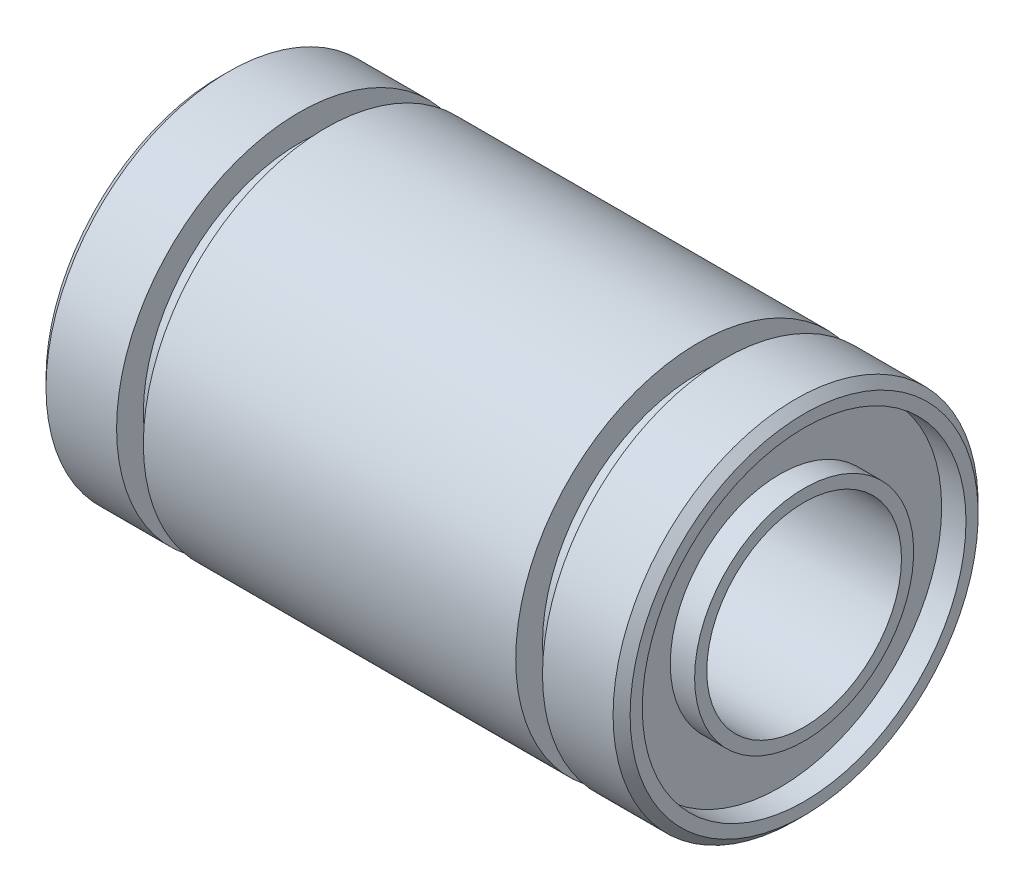
ISO-10303-21;
HEADER;
FILE_DESCRIPTION(('STEP AP214'),'2;1');
FILE_NAME('part.step','',(''),(''),'','','');
FILE_SCHEMA(('AUTOMOTIVE_DESIGN { 1 0 10303 214 1 1 1 1 }'));
ENDSEC;
DATA;
#1=APPLICATION_CONTEXT('core data for automotive mechanical design processes');
#2=APPLICATION_PROTOCOL_DEFINITION('international standard','automotive_design',2000,#1);
#3=PRODUCT_CONTEXT('',#1,'mechanical');
#4=PRODUCT('Part','Part','',(#3));
#5=PRODUCT_RELATED_PRODUCT_CATEGORY('part','',(#4));
#6=PRODUCT_DEFINITION_FORMATION('','',#4);
#7=PRODUCT_DEFINITION_CONTEXT('part definition',#1,'design');
#8=PRODUCT_DEFINITION('design','',#6,#7);
#9=PRODUCT_DEFINITION_SHAPE('','',#8);
#10=(LENGTH_UNIT() NAMED_UNIT(*) SI_UNIT(.MILLI.,.METRE.));
#11=(NAMED_UNIT(*) PLANE_ANGLE_UNIT() SI_UNIT($,.RADIAN.));
#12=(NAMED_UNIT(*) SI_UNIT($,.STERADIAN.) SOLID_ANGLE_UNIT());
#13=UNCERTAINTY_MEASURE_WITH_UNIT(LENGTH_MEASURE(1.E-05),#10,'distance_accuracy_value','');
#14=(GEOMETRIC_REPRESENTATION_CONTEXT(3) GLOBAL_UNCERTAINTY_ASSIGNED_CONTEXT((#13)) GLOBAL_UNIT_ASSIGNED_CONTEXT((#10,
#11,#12)) REPRESENTATION_CONTEXT('',''));
#15=CARTESIAN_POINT('',(0.,0.,0.));
#16=DIRECTION('',(0.,0.,1.));
#17=DIRECTION('',(1.,0.,0.));
#18=AXIS2_PLACEMENT_3D('',#15,#16,#17);
#19=CARTESIAN_POINT('',(11.65,0.,0.));
#20=DIRECTION('',(-1.,0.,0.));
#21=DIRECTION('',(0.,0.,1.));
#22=AXIS2_PLACEMENT_3D('',#19,#20,#21);
#23=CONICAL_SURFACE('',#22,7.5,0.78539816339745);
#24=CARTESIAN_POINT('',(12.,0.,0.));
#25=DIRECTION('',(-1.,0.,0.));
#26=DIRECTION('',(0.,0.,1.));
#27=AXIS2_PLACEMENT_3D('',#24,#25,#26);
#28=CIRCLE('',#27,7.15);
#29=CARTESIAN_POINT('',(12.,0.,7.15));
#30=VERTEX_POINT('',#29);
#31=EDGE_CURVE('E102',#30,#30,#28,.T.);
#32=ORIENTED_EDGE('',*,*,#31,.T.);
#33=EDGE_LOOP('',(#32));
#34=FACE_BOUND('',#33,.T.);
#35=CARTESIAN_POINT('',(11.65,0.,0.));
#36=DIRECTION('',(-1.,0.,0.));
#37=DIRECTION('',(0.,0.,1.));
#38=AXIS2_PLACEMENT_3D('',#35,#36,#37);
#39=CIRCLE('',#38,7.5);
#40=CARTESIAN_POINT('',(11.65,0.,7.5));
#41=VERTEX_POINT('',#40);
#42=EDGE_CURVE('E10',#41,#41,#39,.T.);
#43=ORIENTED_EDGE('',*,*,#42,.F.);
#44=EDGE_LOOP('',(#43));
#45=FACE_BOUND('',#44,.T.);
#46=ADVANCED_FACE('F32',(#34,#45),#23,.T.);
#47=CARTESIAN_POINT('',(-45.6895053247726,0.,0.));
#48=DIRECTION('',(-1.,0.,0.));
#49=DIRECTION('',(0.,0.,1.));
#50=AXIS2_PLACEMENT_3D('',#47,#48,#49);
#51=CYLINDRICAL_SURFACE('',#50,7.5);
#52=CARTESIAN_POINT('',(8.75000000000001,0.,0.));
#53=DIRECTION('',(-1.,0.,0.));
#54=DIRECTION('',(0.,0.,1.));
#55=AXIS2_PLACEMENT_3D('',#52,#53,#54);
#56=CIRCLE('',#55,7.5);
#57=CARTESIAN_POINT('',(8.75000000000001,0.,7.5));
#58=VERTEX_POINT('',#57);
#59=EDGE_CURVE('E38',#58,#58,#56,.T.);
#60=ORIENTED_EDGE('',*,*,#59,.F.);
#61=EDGE_LOOP('',(#60));
#62=FACE_BOUND('',#61,.T.);
#63=ORIENTED_EDGE('',*,*,#42,.T.);
#64=EDGE_LOOP('',(#63));
#65=FACE_BOUND('',#64,.T.);
#66=ADVANCED_FACE('F120',(#62,#65),#51,.T.);
#67=CARTESIAN_POINT('',(8.75000000000001,0.,0.));
#68=DIRECTION('',(1.,0.,0.));
#69=DIRECTION('',(0.,0.,-1.));
#70=AXIS2_PLACEMENT_3D('',#67,#68,#69);
#71=PLANE('',#70);
#72=CARTESIAN_POINT('',(8.75000000000001,0.,0.));
#73=DIRECTION('',(-1.,0.,0.));
#74=DIRECTION('',(0.,0.,1.));
#75=AXIS2_PLACEMENT_3D('',#72,#73,#74);
#76=CIRCLE('',#75,6.4);
#77=CARTESIAN_POINT('',(8.75000000000001,0.,6.4));
#78=VERTEX_POINT('',#77);
#79=EDGE_CURVE('E42',#78,#78,#76,.T.);
#80=ORIENTED_EDGE('',*,*,#79,.F.);
#81=EDGE_LOOP('',(#80));
#82=FACE_BOUND('',#81,.T.);
#83=ORIENTED_EDGE('',*,*,#59,.T.);
#84=EDGE_LOOP('',(#83));
#85=FACE_BOUND('',#84,.T.);
#86=ADVANCED_FACE('F124',(#82,#85),#71,.F.);
#87=CARTESIAN_POINT('',(-45.6895053247726,0.,0.));
#88=DIRECTION('',(-1.,0.,0.));
#89=DIRECTION('',(0.,0.,1.));
#90=AXIS2_PLACEMENT_3D('',#87,#88,#89);
#91=CYLINDRICAL_SURFACE('',#90,6.4);
#92=CARTESIAN_POINT('',(7.65,0.,0.));
#93=DIRECTION('',(-1.,0.,0.));
#94=DIRECTION('',(0.,0.,1.));
#95=AXIS2_PLACEMENT_3D('',#92,#93,#94);
#96=CIRCLE('',#95,6.4);
#97=CARTESIAN_POINT('',(7.65,0.,6.4));
#98=VERTEX_POINT('',#97);
#99=EDGE_CURVE('E46',#98,#98,#96,.T.);
#100=ORIENTED_EDGE('',*,*,#99,.F.);
#101=EDGE_LOOP('',(#100));
#102=FACE_BOUND('',#101,.T.);
#103=ORIENTED_EDGE('',*,*,#79,.T.);
#104=EDGE_LOOP('',(#103));
#105=FACE_BOUND('',#104,.T.);
#106=ADVANCED_FACE('F129',(#102,#105),#91,.T.);
#107=CARTESIAN_POINT('',(7.65,0.,0.));
#108=DIRECTION('',(-1.,0.,0.));
#109=DIRECTION('',(0.,0.,1.));
#110=AXIS2_PLACEMENT_3D('',#107,#108,#109);
#111=PLANE('',#110);
#112=CARTESIAN_POINT('',(7.65,0.,0.));
#113=DIRECTION('',(-1.,0.,0.));
#114=DIRECTION('',(0.,0.,1.));
#115=AXIS2_PLACEMENT_3D('',#112,#113,#114);
#116=CIRCLE('',#115,7.5);
#117=CARTESIAN_POINT('',(7.65,0.,7.5));
#118=VERTEX_POINT('',#117);
#119=EDGE_CURVE('E51',#118,#118,#116,.T.);
#120=ORIENTED_EDGE('',*,*,#119,.F.);
#121=EDGE_LOOP('',(#120));
#122=FACE_BOUND('',#121,.T.);
#123=ORIENTED_EDGE('',*,*,#99,.T.);
#124=EDGE_LOOP('',(#123));
#125=FACE_BOUND('',#124,.T.);
#126=ADVANCED_FACE('F135',(#122,#125),#111,.F.);
#127=CARTESIAN_POINT('',(-45.6895053247726,0.,0.));
#128=DIRECTION('',(-1.,0.,0.));
#129=DIRECTION('',(0.,0.,1.));
#130=AXIS2_PLACEMENT_3D('',#127,#128,#129);
#131=CYLINDRICAL_SURFACE('',#130,7.5);
#132=ORIENTED_EDGE('',*,*,#119,.T.);
#133=EDGE_LOOP('',(#132));
#134=FACE_BOUND('',#133,.T.);
#135=CARTESIAN_POINT('',(-7.65,0.,0.));
#136=DIRECTION('',(-1.,0.,0.));
#137=DIRECTION('',(0.,0.,1.));
#138=AXIS2_PLACEMENT_3D('',#135,#136,#137);
#139=CIRCLE('',#138,7.5);
#140=CARTESIAN_POINT('',(-7.65,0.,7.5));
#141=VERTEX_POINT('',#140);
#142=EDGE_CURVE('E54',#141,#141,#139,.T.);
#143=ORIENTED_EDGE('',*,*,#142,.F.);
#144=EDGE_LOOP('',(#143));
#145=FACE_BOUND('',#144,.T.);
#146=ADVANCED_FACE('F139',(#134,#145),#131,.T.);
#147=CARTESIAN_POINT('',(-7.65,0.,0.));
#148=DIRECTION('',(-1.,0.,0.));
#149=DIRECTION('',(0.,0.,1.));
#150=AXIS2_PLACEMENT_3D('',#147,#148,#149);
#151=PLANE('',#150);
#152=ORIENTED_EDGE('',*,*,#142,.T.);
#153=EDGE_LOOP('',(#152));
#154=FACE_BOUND('',#153,.T.);
#155=CARTESIAN_POINT('',(-7.65,0.,0.));
#156=DIRECTION('',(-1.,0.,0.));
#157=DIRECTION('',(0.,0.,1.));
#158=AXIS2_PLACEMENT_3D('',#155,#156,#157);
#159=CIRCLE('',#158,6.4);
#160=CARTESIAN_POINT('',(-7.65,0.,6.4));
#161=VERTEX_POINT('',#160);
#162=EDGE_CURVE('E57',#161,#161,#159,.T.);
#163=ORIENTED_EDGE('',*,*,#162,.F.);
#164=EDGE_LOOP('',(#163));
#165=FACE_BOUND('',#164,.T.);
#166=ADVANCED_FACE('F143',(#154,#165),#151,.T.);
#167=CARTESIAN_POINT('',(-45.6895053247726,0.,0.));
#168=DIRECTION('',(-1.,0.,0.));
#169=DIRECTION('',(0.,0.,1.));
#170=AXIS2_PLACEMENT_3D('',#167,#168,#169);
#171=CYLINDRICAL_SURFACE('',#170,6.4);
#172=ORIENTED_EDGE('',*,*,#162,.T.);
#173=EDGE_LOOP('',(#172));
#174=FACE_BOUND('',#173,.T.);
#175=CARTESIAN_POINT('',(-8.74999999999999,0.,0.));
#176=DIRECTION('',(-1.,0.,0.));
#177=DIRECTION('',(0.,0.,1.));
#178=AXIS2_PLACEMENT_3D('',#175,#176,#177);
#179=CIRCLE('',#178,6.4);
#180=CARTESIAN_POINT('',(-8.74999999999999,0.,6.4));
#181=VERTEX_POINT('',#180);
#182=EDGE_CURVE('E60',#181,#181,#179,.T.);
#183=ORIENTED_EDGE('',*,*,#182,.F.);
#184=EDGE_LOOP('',(#183));
#185=FACE_BOUND('',#184,.T.);
#186=ADVANCED_FACE('F147',(#174,#185),#171,.T.);
#187=CARTESIAN_POINT('',(-8.75,0.,0.));
#188=DIRECTION('',(1.,0.,0.));
#189=DIRECTION('',(0.,0.,-1.));
#190=AXIS2_PLACEMENT_3D('',#187,#188,#189);
#191=PLANE('',#190);
#192=ORIENTED_EDGE('',*,*,#182,.T.);
#193=EDGE_LOOP('',(#192));
#194=FACE_BOUND('',#193,.T.);
#195=CARTESIAN_POINT('',(-8.74999999999999,0.,0.));
#196=DIRECTION('',(-1.,0.,0.));
#197=DIRECTION('',(0.,0.,1.));
#198=AXIS2_PLACEMENT_3D('',#195,#196,#197);
#199=CIRCLE('',#198,7.5);
#200=CARTESIAN_POINT('',(-8.74999999999999,0.,7.5));
#201=VERTEX_POINT('',#200);
#202=EDGE_CURVE('E63',#201,#201,#199,.T.);
#203=ORIENTED_EDGE('',*,*,#202,.F.);
#204=EDGE_LOOP('',(#203));
#205=FACE_BOUND('',#204,.T.);
#206=ADVANCED_FACE('F151',(#194,#205),#191,.T.);
#207=CARTESIAN_POINT('',(-45.6895053247726,0.,0.));
#208=DIRECTION('',(-1.,0.,0.));
#209=DIRECTION('',(0.,0.,1.));
#210=AXIS2_PLACEMENT_3D('',#207,#208,#209);
#211=CYLINDRICAL_SURFACE('',#210,7.5);
#212=ORIENTED_EDGE('',*,*,#202,.T.);
#213=EDGE_LOOP('',(#212));
#214=FACE_BOUND('',#213,.T.);
#215=CARTESIAN_POINT('',(-11.65,0.,0.));
#216=DIRECTION('',(-1.,0.,0.));
#217=DIRECTION('',(0.,0.,1.));
#218=AXIS2_PLACEMENT_3D('',#215,#216,#217);
#219=CIRCLE('',#218,7.5);
#220=CARTESIAN_POINT('',(-11.65,0.,7.5));
#221=VERTEX_POINT('',#220);
#222=EDGE_CURVE('E66',#221,#221,#219,.T.);
#223=ORIENTED_EDGE('',*,*,#222,.F.);
#224=EDGE_LOOP('',(#223));
#225=FACE_BOUND('',#224,.T.);
#226=ADVANCED_FACE('F155',(#214,#225),#211,.T.);
#227=CARTESIAN_POINT('',(-11.65,0.,0.));
#228=DIRECTION('',(1.,0.,0.));
#229=DIRECTION('',(0.,0.,-1.));
#230=AXIS2_PLACEMENT_3D('',#227,#228,#229);
#231=CONICAL_SURFACE('',#230,7.5,0.78539816339745);
#232=CARTESIAN_POINT('',(-12.,0.,0.));
#233=DIRECTION('',(-1.,0.,0.));
#234=DIRECTION('',(0.,0.,1.));
#235=AXIS2_PLACEMENT_3D('',#232,#233,#234);
#236=CIRCLE('',#235,7.15);
#237=CARTESIAN_POINT('',(-12.,0.,7.15));
#238=VERTEX_POINT('',#237);
#239=EDGE_CURVE('E69',#238,#238,#236,.T.);
#240=ORIENTED_EDGE('',*,*,#239,.F.);
#241=EDGE_LOOP('',(#240));
#242=FACE_BOUND('',#241,.T.);
#243=ORIENTED_EDGE('',*,*,#222,.T.);
#244=EDGE_LOOP('',(#243));
#245=FACE_BOUND('',#244,.T.);
#246=ADVANCED_FACE('F159',(#242,#245),#231,.T.);
#247=CARTESIAN_POINT('',(-12.,0.,0.));
#248=DIRECTION('',(1.,0.,0.));
#249=DIRECTION('',(0.,0.,-1.));
#250=AXIS2_PLACEMENT_3D('',#247,#248,#249);
#251=PLANE('',#250);
#252=CARTESIAN_POINT('',(-12.,0.,0.));
#253=DIRECTION('',(-1.,0.,0.));
#254=DIRECTION('',(0.,0.,1.));
#255=AXIS2_PLACEMENT_3D('',#252,#253,#254);
#256=CIRCLE('',#255,6.65);
#257=CARTESIAN_POINT('',(-12.,0.,6.65));
#258=VERTEX_POINT('',#257);
#259=EDGE_CURVE('E72',#258,#258,#256,.T.);
#260=ORIENTED_EDGE('',*,*,#259,.F.);
#261=EDGE_LOOP('',(#260));
#262=FACE_BOUND('',#261,.T.);
#263=ORIENTED_EDGE('',*,*,#239,.T.);
#264=EDGE_LOOP('',(#263));
#265=FACE_BOUND('',#264,.T.);
#266=ADVANCED_FACE('F163',(#262,#265),#251,.F.);
#267=CARTESIAN_POINT('',(-45.6895053247726,0.,0.));
#268=DIRECTION('',(-1.,0.,0.));
#269=DIRECTION('',(0.,0.,1.));
#270=AXIS2_PLACEMENT_3D('',#267,#268,#269);
#271=CYLINDRICAL_SURFACE('',#270,6.65);
#272=CARTESIAN_POINT('',(-11.,0.,0.));
#273=DIRECTION('',(-1.,0.,0.));
#274=DIRECTION('',(0.,0.,1.));
#275=AXIS2_PLACEMENT_3D('',#272,#273,#274);
#276=CIRCLE('',#275,6.65);
#277=CARTESIAN_POINT('',(-11.,0.,6.65));
#278=VERTEX_POINT('',#277);
#279=EDGE_CURVE('E75',#278,#278,#276,.T.);
#280=ORIENTED_EDGE('',*,*,#279,.F.);
#281=EDGE_LOOP('',(#280));
#282=FACE_BOUND('',#281,.T.);
#283=ORIENTED_EDGE('',*,*,#259,.T.);
#284=EDGE_LOOP('',(#283));
#285=FACE_BOUND('',#284,.T.);
#286=ADVANCED_FACE('F167',(#282,#285),#271,.F.);
#287=CARTESIAN_POINT('',(-11.,0.,0.));
#288=DIRECTION('',(1.,0.,0.));
#289=DIRECTION('',(0.,0.,-1.));
#290=AXIS2_PLACEMENT_3D('',#287,#288,#289);
#291=PLANE('',#290);
#292=CARTESIAN_POINT('',(-11.,0.,0.));
#293=DIRECTION('',(-1.,0.,0.));
#294=DIRECTION('',(0.,0.,1.));
#295=AXIS2_PLACEMENT_3D('',#292,#293,#294);
#296=CIRCLE('',#295,4.5);
#297=CARTESIAN_POINT('',(-11.,0.,4.5));
#298=VERTEX_POINT('',#297);
#299=EDGE_CURVE('E78',#298,#298,#296,.T.);
#300=ORIENTED_EDGE('',*,*,#299,.F.);
#301=EDGE_LOOP('',(#300));
#302=FACE_BOUND('',#301,.T.);
#303=ORIENTED_EDGE('',*,*,#279,.T.);
#304=EDGE_LOOP('',(#303));
#305=FACE_BOUND('',#304,.T.);
#306=ADVANCED_FACE('F171',(#302,#305),#291,.F.);
#307=CARTESIAN_POINT('',(-45.6895053247726,0.,0.));
#308=DIRECTION('',(-1.,0.,0.));
#309=DIRECTION('',(0.,0.,1.));
#310=AXIS2_PLACEMENT_3D('',#307,#308,#309);
#311=CYLINDRICAL_SURFACE('',#310,4.5);
#312=CARTESIAN_POINT('',(-12.,0.,0.));
#313=DIRECTION('',(-1.,0.,0.));
#314=DIRECTION('',(0.,0.,1.));
#315=AXIS2_PLACEMENT_3D('',#312,#313,#314);
#316=CIRCLE('',#315,4.5);
#317=CARTESIAN_POINT('',(-12.,0.,4.5));
#318=VERTEX_POINT('',#317);
#319=EDGE_CURVE('E81',#318,#318,#316,.T.);
#320=ORIENTED_EDGE('',*,*,#319,.F.);
#321=EDGE_LOOP('',(#320));
#322=FACE_BOUND('',#321,.T.);
#323=ORIENTED_EDGE('',*,*,#299,.T.);
#324=EDGE_LOOP('',(#323));
#325=FACE_BOUND('',#324,.T.);
#326=ADVANCED_FACE('F175',(#322,#325),#311,.T.);
#327=CARTESIAN_POINT('',(-12.,0.,0.));
#328=DIRECTION('',(1.,0.,0.));
#329=DIRECTION('',(0.,0.,-1.));
#330=AXIS2_PLACEMENT_3D('',#327,#328,#329);
#331=PLANE('',#330);
#332=CARTESIAN_POINT('',(-12.,0.,0.));
#333=DIRECTION('',(-1.,0.,0.));
#334=DIRECTION('',(0.,0.,1.));
#335=AXIS2_PLACEMENT_3D('',#332,#333,#334);
#336=CIRCLE('',#335,4.);
#337=CARTESIAN_POINT('',(-12.,0.,4.));
#338=VERTEX_POINT('',#337);
#339=EDGE_CURVE('E84',#338,#338,#336,.T.);
#340=ORIENTED_EDGE('',*,*,#339,.F.);
#341=EDGE_LOOP('',(#340));
#342=FACE_BOUND('',#341,.T.);
#343=ORIENTED_EDGE('',*,*,#319,.T.);
#344=EDGE_LOOP('',(#343));
#345=FACE_BOUND('',#344,.T.);
#346=ADVANCED_FACE('F179',(#342,#345),#331,.F.);
#347=CARTESIAN_POINT('',(-45.6895053247726,0.,0.));
#348=DIRECTION('',(-1.,0.,0.));
#349=DIRECTION('',(0.,0.,1.));
#350=AXIS2_PLACEMENT_3D('',#347,#348,#349);
#351=CYLINDRICAL_SURFACE('',#350,4.);
#352=CARTESIAN_POINT('',(12.,0.,0.));
#353=DIRECTION('',(-1.,0.,0.));
#354=DIRECTION('',(0.,0.,1.));
#355=AXIS2_PLACEMENT_3D('',#352,#353,#354);
#356=CIRCLE('',#355,4.);
#357=CARTESIAN_POINT('',(12.,0.,4.));
#358=VERTEX_POINT('',#357);
#359=EDGE_CURVE('E87',#358,#358,#356,.T.);
#360=ORIENTED_EDGE('',*,*,#359,.F.);
#361=EDGE_LOOP('',(#360));
#362=FACE_BOUND('',#361,.T.);
#363=ORIENTED_EDGE('',*,*,#339,.T.);
#364=EDGE_LOOP('',(#363));
#365=FACE_BOUND('',#364,.T.);
#366=ADVANCED_FACE('F183',(#362,#365),#351,.F.);
#367=CARTESIAN_POINT('',(12.,0.,0.));
#368=DIRECTION('',(1.,0.,0.));
#369=DIRECTION('',(0.,0.,-1.));
#370=AXIS2_PLACEMENT_3D('',#367,#368,#369);
#371=PLANE('',#370);
#372=ORIENTED_EDGE('',*,*,#359,.T.);
#373=EDGE_LOOP('',(#372));
#374=FACE_BOUND('',#373,.T.);
#375=CARTESIAN_POINT('',(12.,0.,0.));
#376=DIRECTION('',(-1.,0.,0.));
#377=DIRECTION('',(0.,0.,1.));
#378=AXIS2_PLACEMENT_3D('',#375,#376,#377);
#379=CIRCLE('',#378,4.5);
#380=CARTESIAN_POINT('',(12.,0.,4.5));
#381=VERTEX_POINT('',#380);
#382=EDGE_CURVE('E90',#381,#381,#379,.T.);
#383=ORIENTED_EDGE('',*,*,#382,.F.);
#384=EDGE_LOOP('',(#383));
#385=FACE_BOUND('',#384,.T.);
#386=ADVANCED_FACE('F187',(#374,#385),#371,.T.);
#387=CARTESIAN_POINT('',(-45.6895053247726,0.,0.));
#388=DIRECTION('',(-1.,0.,0.));
#389=DIRECTION('',(0.,0.,1.));
#390=AXIS2_PLACEMENT_3D('',#387,#388,#389);
#391=CYLINDRICAL_SURFACE('',#390,4.5);
#392=ORIENTED_EDGE('',*,*,#382,.T.);
#393=EDGE_LOOP('',(#392));
#394=FACE_BOUND('',#393,.T.);
#395=CARTESIAN_POINT('',(11.,0.,0.));
#396=DIRECTION('',(-1.,0.,0.));
#397=DIRECTION('',(0.,0.,1.));
#398=AXIS2_PLACEMENT_3D('',#395,#396,#397);
#399=CIRCLE('',#398,4.5);
#400=CARTESIAN_POINT('',(11.,0.,4.5));
#401=VERTEX_POINT('',#400);
#402=EDGE_CURVE('E93',#401,#401,#399,.T.);
#403=ORIENTED_EDGE('',*,*,#402,.F.);
#404=EDGE_LOOP('',(#403));
#405=FACE_BOUND('',#404,.T.);
#406=ADVANCED_FACE('F191',(#394,#405),#391,.T.);
#407=CARTESIAN_POINT('',(11.,0.,0.));
#408=DIRECTION('',(1.,0.,0.));
#409=DIRECTION('',(0.,0.,-1.));
#410=AXIS2_PLACEMENT_3D('',#407,#408,#409);
#411=PLANE('',#410);
#412=ORIENTED_EDGE('',*,*,#402,.T.);
#413=EDGE_LOOP('',(#412));
#414=FACE_BOUND('',#413,.T.);
#415=CARTESIAN_POINT('',(11.,0.,0.));
#416=DIRECTION('',(-1.,0.,0.));
#417=DIRECTION('',(0.,0.,1.));
#418=AXIS2_PLACEMENT_3D('',#415,#416,#417);
#419=CIRCLE('',#418,6.65);
#420=CARTESIAN_POINT('',(11.,0.,6.65));
#421=VERTEX_POINT('',#420);
#422=EDGE_CURVE('E96',#421,#421,#419,.T.);
#423=ORIENTED_EDGE('',*,*,#422,.F.);
#424=EDGE_LOOP('',(#423));
#425=FACE_BOUND('',#424,.T.);
#426=ADVANCED_FACE('F116',(#414,#425),#411,.T.);
#427=CARTESIAN_POINT('',(-45.6895053247726,0.,0.));
#428=DIRECTION('',(-1.,0.,0.));
#429=DIRECTION('',(0.,0.,1.));
#430=AXIS2_PLACEMENT_3D('',#427,#428,#429);
#431=CYLINDRICAL_SURFACE('',#430,6.65);
#432=ORIENTED_EDGE('',*,*,#422,.T.);
#433=EDGE_LOOP('',(#432));
#434=FACE_BOUND('',#433,.T.);
#435=CARTESIAN_POINT('',(12.,0.,0.));
#436=DIRECTION('',(-1.,0.,0.));
#437=DIRECTION('',(0.,0.,1.));
#438=AXIS2_PLACEMENT_3D('',#435,#436,#437);
#439=CIRCLE('',#438,6.65);
#440=CARTESIAN_POINT('',(12.,0.,6.65));
#441=VERTEX_POINT('',#440);
#442=EDGE_CURVE('E99',#441,#441,#439,.T.);
#443=ORIENTED_EDGE('',*,*,#442,.F.);
#444=EDGE_LOOP('',(#443));
#445=FACE_BOUND('',#444,.T.);
#446=ADVANCED_FACE('F110',(#434,#445),#431,.F.);
#447=CARTESIAN_POINT('',(12.,0.,0.));
#448=DIRECTION('',(1.,0.,0.));
#449=DIRECTION('',(0.,0.,-1.));
#450=AXIS2_PLACEMENT_3D('',#447,#448,#449);
#451=PLANE('',#450);
#452=ORIENTED_EDGE('',*,*,#442,.T.);
#453=EDGE_LOOP('',(#452));
#454=FACE_BOUND('',#453,.T.);
#455=ORIENTED_EDGE('',*,*,#31,.F.);
#456=EDGE_LOOP('',(#455));
#457=FACE_BOUND('',#456,.T.);
#458=ADVANCED_FACE('F108',(#454,#457),#451,.T.);
#459=CLOSED_SHELL('',(#46,#66,#86,#106,#126,#146,#166,#186,#206,#226,#246,#266,#286,#306,#326,
#346,#366,#386,#406,#426,#446,#458));
#460=MANIFOLD_SOLID_BREP('B2',#459);
#461=ADVANCED_BREP_SHAPE_REPRESENTATION('',(#18,#460),#14);
#462=SHAPE_DEFINITION_REPRESENTATION(#9,#461);
ENDSEC;
END-ISO-10303-21;
